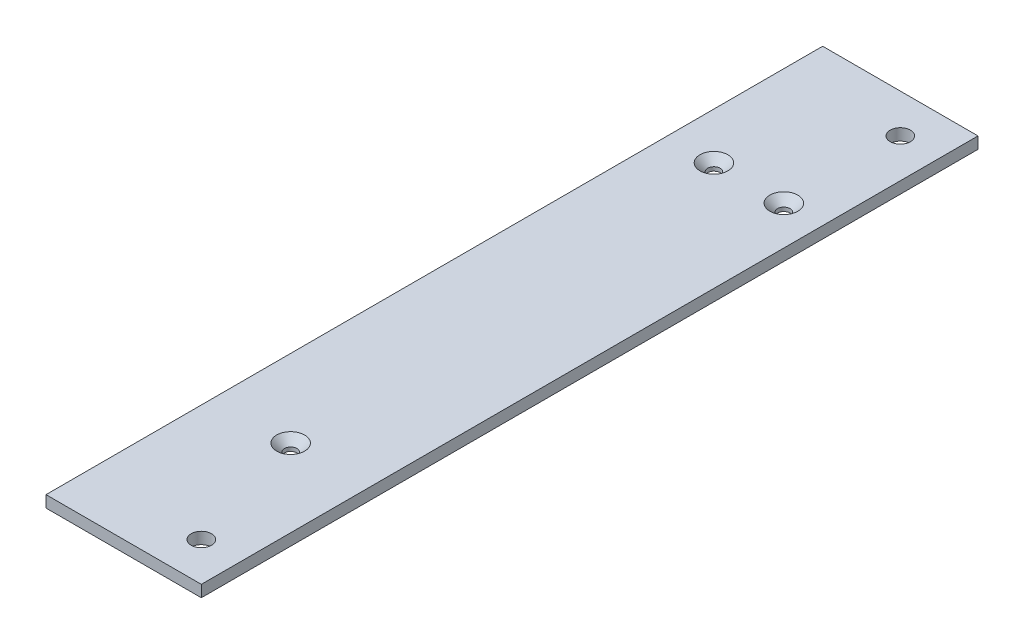
ISO-10303-21;
HEADER;
FILE_DESCRIPTION(('STEP AP214'),'2;1');
FILE_NAME('part.step','',(''),(''),'','','');
FILE_SCHEMA(('AUTOMOTIVE_DESIGN { 1 0 10303 214 1 1 1 1 }'));
ENDSEC;
DATA;
#1=APPLICATION_CONTEXT('core data for automotive mechanical design processes');
#2=APPLICATION_PROTOCOL_DEFINITION('international standard','automotive_design',2000,#1);
#3=PRODUCT_CONTEXT('',#1,'mechanical');
#4=PRODUCT('Part','Part','',(#3));
#5=PRODUCT_RELATED_PRODUCT_CATEGORY('part','',(#4));
#6=PRODUCT_DEFINITION_FORMATION('','',#4);
#7=PRODUCT_DEFINITION_CONTEXT('part definition',#1,'design');
#8=PRODUCT_DEFINITION('design','',#6,#7);
#9=PRODUCT_DEFINITION_SHAPE('','',#8);
#10=(LENGTH_UNIT() NAMED_UNIT(*) SI_UNIT(.MILLI.,.METRE.));
#11=(NAMED_UNIT(*) PLANE_ANGLE_UNIT() SI_UNIT($,.RADIAN.));
#12=(NAMED_UNIT(*) SI_UNIT($,.STERADIAN.) SOLID_ANGLE_UNIT());
#13=UNCERTAINTY_MEASURE_WITH_UNIT(LENGTH_MEASURE(1.E-05),#10,'distance_accuracy_value','');
#14=(GEOMETRIC_REPRESENTATION_CONTEXT(3) GLOBAL_UNCERTAINTY_ASSIGNED_CONTEXT((#13)) GLOBAL_UNIT_ASSIGNED_CONTEXT((#10,
#11,#12)) REPRESENTATION_CONTEXT('',''));
#15=CARTESIAN_POINT('',(0.,0.,0.));
#16=DIRECTION('',(0.,0.,1.));
#17=DIRECTION('',(1.,0.,0.));
#18=AXIS2_PLACEMENT_3D('',#15,#16,#17);
#19=CARTESIAN_POINT('',(0.,3.,0.));
#20=DIRECTION('',(0.,-1.,0.));
#21=DIRECTION('',(0.,0.,-1.));
#22=AXIS2_PLACEMENT_3D('',#19,#20,#21);
#23=PLANE('',#22);
#24=CARTESIAN_POINT('',(0.,3.,57.));
#25=DIRECTION('',(0.,-1.,0.));
#26=DIRECTION('',(0.,0.,-1.));
#27=AXIS2_PLACEMENT_3D('',#24,#25,#26);
#28=CIRCLE('',#27,3.59999999999996);
#29=CARTESIAN_POINT('',(0.,3.,53.4));
#30=VERTEX_POINT('',#29);
#31=EDGE_CURVE('E143',#30,#30,#28,.T.);
#32=ORIENTED_EDGE('',*,*,#31,.T.);
#33=EDGE_LOOP('',(#32));
#34=FACE_BOUND('',#33,.T.);
#35=CARTESIAN_POINT('',(-7.99999999999995,3.,-60.));
#36=DIRECTION('',(0.,-1.,0.));
#37=DIRECTION('',(0.,0.,-1.));
#38=AXIS2_PLACEMENT_3D('',#35,#36,#37);
#39=CIRCLE('',#38,3.59999999999996);
#40=CARTESIAN_POINT('',(-7.99999999999995,3.,-63.6));
#41=VERTEX_POINT('',#40);
#42=EDGE_CURVE('E139',#41,#41,#39,.T.);
#43=ORIENTED_EDGE('',*,*,#42,.T.);
#44=EDGE_LOOP('',(#43));
#45=FACE_BOUND('',#44,.T.);
#46=CARTESIAN_POINT('',(10.,3.,-60.));
#47=DIRECTION('',(0.,-1.,0.));
#48=DIRECTION('',(0.,0.,-1.));
#49=AXIS2_PLACEMENT_3D('',#46,#47,#48);
#50=CIRCLE('',#49,3.59999999999996);
#51=CARTESIAN_POINT('',(10.,3.,-63.6));
#52=VERTEX_POINT('',#51);
#53=EDGE_CURVE('E135',#52,#52,#50,.T.);
#54=ORIENTED_EDGE('',*,*,#53,.T.);
#55=EDGE_LOOP('',(#54));
#56=FACE_BOUND('',#55,.T.);
#57=DIRECTION('',(0.,0.,-1.));
#58=VECTOR('',#57,1.);
#59=CARTESIAN_POINT('',(20.,3.,100.));
#60=LINE('',#59,#58);
#61=CARTESIAN_POINT('',(20.,3.,100.));
#62=VERTEX_POINT('',#61);
#63=CARTESIAN_POINT('',(20.,3.,-100.));
#64=VERTEX_POINT('',#63);
#65=EDGE_CURVE('E95',#62,#64,#60,.T.);
#66=ORIENTED_EDGE('',*,*,#65,.T.);
#67=DIRECTION('',(-1.,0.,0.));
#68=VECTOR('',#67,1.);
#69=CARTESIAN_POINT('',(-20.,3.,-100.));
#70=LINE('',#69,#68);
#71=CARTESIAN_POINT('',(-20.,3.,-100.));
#72=VERTEX_POINT('',#71);
#73=EDGE_CURVE('E90',#64,#72,#70,.T.);
#74=ORIENTED_EDGE('',*,*,#73,.T.);
#75=DIRECTION('',(0.,0.,1.));
#76=VECTOR('',#75,1.);
#77=CARTESIAN_POINT('',(-20.,3.,100.));
#78=LINE('',#77,#76);
#79=CARTESIAN_POINT('',(-20.,3.,100.));
#80=VERTEX_POINT('',#79);
#81=EDGE_CURVE('E93',#72,#80,#78,.T.);
#82=ORIENTED_EDGE('',*,*,#81,.T.);
#83=DIRECTION('',(1.,0.,0.));
#84=VECTOR('',#83,1.);
#85=CARTESIAN_POINT('',(-20.,3.,100.));
#86=LINE('',#85,#84);
#87=EDGE_CURVE('E59',#80,#62,#86,.T.);
#88=ORIENTED_EDGE('',*,*,#87,.T.);
#89=EDGE_LOOP('',(#66,#74,#82,#88));
#90=FACE_BOUND('',#89,.T.);
#91=CARTESIAN_POINT('',(10.0000000000001,3.,90.));
#92=DIRECTION('',(0.,1.,0.));
#93=DIRECTION('',(0.,0.,1.));
#94=AXIS2_PLACEMENT_3D('',#91,#92,#93);
#95=CIRCLE('',#94,2.60000000000001);
#96=CARTESIAN_POINT('',(10.0000000000001,3.,92.6));
#97=VERTEX_POINT('',#96);
#98=EDGE_CURVE('E118',#97,#97,#95,.T.);
#99=ORIENTED_EDGE('',*,*,#98,.F.);
#100=EDGE_LOOP('',(#99));
#101=FACE_BOUND('',#100,.T.);
#102=CARTESIAN_POINT('',(10.,3.,-90.));
#103=DIRECTION('',(0.,1.,0.));
#104=DIRECTION('',(0.,0.,1.));
#105=AXIS2_PLACEMENT_3D('',#102,#103,#104);
#106=CIRCLE('',#105,2.60000000000001);
#107=CARTESIAN_POINT('',(10.,3.,-87.4));
#108=VERTEX_POINT('',#107);
#109=EDGE_CURVE('E225',#108,#108,#106,.T.);
#110=ORIENTED_EDGE('',*,*,#109,.F.);
#111=EDGE_LOOP('',(#110));
#112=FACE_BOUND('',#111,.T.);
#113=ADVANCED_FACE('F40',(#34,#45,#56,#90,#101,#112),#23,.F.);
#114=CARTESIAN_POINT('',(0.,0.,0.));
#115=DIRECTION('',(0.,-1.,0.));
#116=DIRECTION('',(0.,0.,-1.));
#117=AXIS2_PLACEMENT_3D('',#114,#115,#116);
#118=PLANE('',#117);
#119=CARTESIAN_POINT('',(-7.99999999999995,0.,-60.));
#120=DIRECTION('',(0.,1.,0.));
#121=DIRECTION('',(0.,0.,1.));
#122=AXIS2_PLACEMENT_3D('',#119,#120,#121);
#123=CIRCLE('',#122,1.60000000000001);
#124=CARTESIAN_POINT('',(-7.99999999999995,0.,-58.4));
#125=VERTEX_POINT('',#124);
#126=EDGE_CURVE('E216',#125,#125,#123,.T.);
#127=ORIENTED_EDGE('',*,*,#126,.T.);
#128=EDGE_LOOP('',(#127));
#129=FACE_BOUND('',#128,.T.);
#130=CARTESIAN_POINT('',(10.,0.,-90.));
#131=DIRECTION('',(0.,1.,0.));
#132=DIRECTION('',(0.,0.,1.));
#133=AXIS2_PLACEMENT_3D('',#130,#131,#132);
#134=CIRCLE('',#133,2.60000000000001);
#135=CARTESIAN_POINT('',(10.,0.,-87.4));
#136=VERTEX_POINT('',#135);
#137=EDGE_CURVE('E224',#136,#136,#134,.T.);
#138=ORIENTED_EDGE('',*,*,#137,.T.);
#139=EDGE_LOOP('',(#138));
#140=FACE_BOUND('',#139,.T.);
#141=DIRECTION('',(0.,0.,-1.));
#142=VECTOR('',#141,1.);
#143=CARTESIAN_POINT('',(20.,0.,100.));
#144=LINE('',#143,#142);
#145=CARTESIAN_POINT('',(20.,0.,100.));
#146=VERTEX_POINT('',#145);
#147=CARTESIAN_POINT('',(20.,0.,-100.));
#148=VERTEX_POINT('',#147);
#149=EDGE_CURVE('E114',#146,#148,#144,.T.);
#150=ORIENTED_EDGE('',*,*,#149,.F.);
#151=DIRECTION('',(1.,0.,0.));
#152=VECTOR('',#151,1.);
#153=CARTESIAN_POINT('',(-20.,0.,100.));
#154=LINE('',#153,#152);
#155=CARTESIAN_POINT('',(-20.,0.,100.));
#156=VERTEX_POINT('',#155);
#157=EDGE_CURVE('E82',#156,#146,#154,.T.);
#158=ORIENTED_EDGE('',*,*,#157,.F.);
#159=DIRECTION('',(0.,0.,1.));
#160=VECTOR('',#159,1.);
#161=CARTESIAN_POINT('',(-20.,0.,100.));
#162=LINE('',#161,#160);
#163=CARTESIAN_POINT('',(-20.,0.,-100.));
#164=VERTEX_POINT('',#163);
#165=EDGE_CURVE('E76',#164,#156,#162,.T.);
#166=ORIENTED_EDGE('',*,*,#165,.F.);
#167=DIRECTION('',(-1.,0.,0.));
#168=VECTOR('',#167,1.);
#169=CARTESIAN_POINT('',(-20.,0.,-100.));
#170=LINE('',#169,#168);
#171=EDGE_CURVE('E101',#148,#164,#170,.T.);
#172=ORIENTED_EDGE('',*,*,#171,.F.);
#173=EDGE_LOOP('',(#150,#158,#166,#172));
#174=FACE_BOUND('',#173,.T.);
#175=CARTESIAN_POINT('',(10.0000000000001,0.,90.));
#176=DIRECTION('',(0.,1.,0.));
#177=DIRECTION('',(0.,0.,1.));
#178=AXIS2_PLACEMENT_3D('',#175,#176,#177);
#179=CIRCLE('',#178,2.60000000000001);
#180=CARTESIAN_POINT('',(10.0000000000001,0.,92.6));
#181=VERTEX_POINT('',#180);
#182=EDGE_CURVE('E206',#181,#181,#179,.T.);
#183=ORIENTED_EDGE('',*,*,#182,.T.);
#184=EDGE_LOOP('',(#183));
#185=FACE_BOUND('',#184,.T.);
#186=CARTESIAN_POINT('',(10.,0.,-60.));
#187=DIRECTION('',(0.,1.,0.));
#188=DIRECTION('',(0.,0.,1.));
#189=AXIS2_PLACEMENT_3D('',#186,#187,#188);
#190=CIRCLE('',#189,1.6);
#191=CARTESIAN_POINT('',(10.,0.,-58.4));
#192=VERTEX_POINT('',#191);
#193=EDGE_CURVE('E210',#192,#192,#190,.T.);
#194=ORIENTED_EDGE('',*,*,#193,.T.);
#195=EDGE_LOOP('',(#194));
#196=FACE_BOUND('',#195,.T.);
#197=CARTESIAN_POINT('',(0.,0.,57.));
#198=DIRECTION('',(0.,1.,0.));
#199=DIRECTION('',(0.,0.,1.));
#200=AXIS2_PLACEMENT_3D('',#197,#198,#199);
#201=CIRCLE('',#200,1.6);
#202=CARTESIAN_POINT('',(0.,0.,58.6));
#203=VERTEX_POINT('',#202);
#204=EDGE_CURVE('E213',#203,#203,#201,.T.);
#205=ORIENTED_EDGE('',*,*,#204,.T.);
#206=EDGE_LOOP('',(#205));
#207=FACE_BOUND('',#206,.T.);
#208=ADVANCED_FACE('F168',(#129,#140,#174,#185,#196,#207),#118,.T.);
#209=CARTESIAN_POINT('',(20.,3.,100.));
#210=DIRECTION('',(-1.,0.,0.));
#211=DIRECTION('',(0.,0.,1.));
#212=AXIS2_PLACEMENT_3D('',#209,#210,#211);
#213=PLANE('',#212);
#214=ORIENTED_EDGE('',*,*,#149,.T.);
#215=DIRECTION('',(0.,-1.,0.));
#216=VECTOR('',#215,1.);
#217=CARTESIAN_POINT('',(20.,3.,-100.));
#218=LINE('',#217,#216);
#219=EDGE_CURVE('E103',#64,#148,#218,.T.);
#220=ORIENTED_EDGE('',*,*,#219,.F.);
#221=ORIENTED_EDGE('',*,*,#65,.F.);
#222=DIRECTION('',(0.,-1.,0.));
#223=VECTOR('',#222,1.);
#224=CARTESIAN_POINT('',(20.,3.,100.));
#225=LINE('',#224,#223);
#226=EDGE_CURVE('E110',#62,#146,#225,.T.);
#227=ORIENTED_EDGE('',*,*,#226,.T.);
#228=EDGE_LOOP('',(#214,#220,#221,#227));
#229=FACE_BOUND('',#228,.T.);
#230=ADVANCED_FACE('F174',(#229),#213,.F.);
#231=CARTESIAN_POINT('',(-20.,3.,-100.));
#232=DIRECTION('',(0.,0.,1.));
#233=DIRECTION('',(1.,0.,0.));
#234=AXIS2_PLACEMENT_3D('',#231,#232,#233);
#235=PLANE('',#234);
#236=ORIENTED_EDGE('',*,*,#171,.T.);
#237=DIRECTION('',(0.,-1.,0.));
#238=VECTOR('',#237,1.);
#239=CARTESIAN_POINT('',(-20.,3.,-100.));
#240=LINE('',#239,#238);
#241=EDGE_CURVE('E99',#72,#164,#240,.T.);
#242=ORIENTED_EDGE('',*,*,#241,.F.);
#243=ORIENTED_EDGE('',*,*,#73,.F.);
#244=ORIENTED_EDGE('',*,*,#219,.T.);
#245=EDGE_LOOP('',(#236,#242,#243,#244));
#246=FACE_BOUND('',#245,.T.);
#247=ADVANCED_FACE('F100',(#246),#235,.F.);
#248=CARTESIAN_POINT('',(-20.,3.,100.));
#249=DIRECTION('',(1.,0.,0.));
#250=DIRECTION('',(0.,0.,-1.));
#251=AXIS2_PLACEMENT_3D('',#248,#249,#250);
#252=PLANE('',#251);
#253=ORIENTED_EDGE('',*,*,#165,.T.);
#254=DIRECTION('',(0.,-1.,0.));
#255=VECTOR('',#254,1.);
#256=CARTESIAN_POINT('',(-20.,3.,100.));
#257=LINE('',#256,#255);
#258=EDGE_CURVE('E104',#80,#156,#257,.T.);
#259=ORIENTED_EDGE('',*,*,#258,.F.);
#260=ORIENTED_EDGE('',*,*,#81,.F.);
#261=ORIENTED_EDGE('',*,*,#241,.T.);
#262=EDGE_LOOP('',(#253,#259,#260,#261));
#263=FACE_BOUND('',#262,.T.);
#264=ADVANCED_FACE('F106',(#263),#252,.F.);
#265=CARTESIAN_POINT('',(-20.,3.,100.));
#266=DIRECTION('',(0.,0.,-1.));
#267=DIRECTION('',(-1.,0.,0.));
#268=AXIS2_PLACEMENT_3D('',#265,#266,#267);
#269=PLANE('',#268);
#270=ORIENTED_EDGE('',*,*,#157,.T.);
#271=ORIENTED_EDGE('',*,*,#226,.F.);
#272=ORIENTED_EDGE('',*,*,#87,.F.);
#273=ORIENTED_EDGE('',*,*,#258,.T.);
#274=EDGE_LOOP('',(#270,#271,#272,#273));
#275=FACE_BOUND('',#274,.T.);
#276=ADVANCED_FACE('F182',(#275),#269,.F.);
#277=CARTESIAN_POINT('',(10.0000000000001,3.,90.));
#278=DIRECTION('',(0.,-1.,0.));
#279=DIRECTION('',(0.,0.,-1.));
#280=AXIS2_PLACEMENT_3D('',#277,#278,#279);
#281=CYLINDRICAL_SURFACE('',#280,2.60000000000001);
#282=ORIENTED_EDGE('',*,*,#98,.T.);
#283=EDGE_LOOP('',(#282));
#284=FACE_BOUND('',#283,.T.);
#285=ORIENTED_EDGE('',*,*,#182,.F.);
#286=EDGE_LOOP('',(#285));
#287=FACE_BOUND('',#286,.T.);
#288=ADVANCED_FACE('F179',(#284,#287),#281,.F.);
#289=CARTESIAN_POINT('',(10.,3.,-90.));
#290=DIRECTION('',(0.,-1.,0.));
#291=DIRECTION('',(0.,0.,-1.));
#292=AXIS2_PLACEMENT_3D('',#289,#290,#291);
#293=CYLINDRICAL_SURFACE('',#292,2.60000000000001);
#294=ORIENTED_EDGE('',*,*,#109,.T.);
#295=EDGE_LOOP('',(#294));
#296=FACE_BOUND('',#295,.T.);
#297=ORIENTED_EDGE('',*,*,#137,.F.);
#298=EDGE_LOOP('',(#297));
#299=FACE_BOUND('',#298,.T.);
#300=ADVANCED_FACE('F243',(#296,#299),#293,.F.);
#301=CARTESIAN_POINT('',(10.,3.,-60.));
#302=DIRECTION('',(0.,-1.,0.));
#303=DIRECTION('',(0.,0.,-1.));
#304=AXIS2_PLACEMENT_3D('',#301,#302,#303);
#305=CYLINDRICAL_SURFACE('',#304,1.6);
#306=CARTESIAN_POINT('',(10.,1.00000000000003,-60.));
#307=DIRECTION('',(0.,-1.,0.));
#308=DIRECTION('',(0.,0.,-1.));
#309=AXIS2_PLACEMENT_3D('',#306,#307,#308);
#310=CIRCLE('',#309,1.6);
#311=CARTESIAN_POINT('',(10.,1.00000000000003,-61.6));
#312=VERTEX_POINT('',#311);
#313=EDGE_CURVE('E11',#312,#312,#310,.F.);
#314=ORIENTED_EDGE('',*,*,#313,.T.);
#315=EDGE_LOOP('',(#314));
#316=FACE_BOUND('',#315,.T.);
#317=ORIENTED_EDGE('',*,*,#193,.F.);
#318=EDGE_LOOP('',(#317));
#319=FACE_BOUND('',#318,.T.);
#320=ADVANCED_FACE('F246',(#316,#319),#305,.F.);
#321=CARTESIAN_POINT('',(-7.99999999999995,3.,-60.));
#322=DIRECTION('',(0.,-1.,0.));
#323=DIRECTION('',(0.,0.,-1.));
#324=AXIS2_PLACEMENT_3D('',#321,#322,#323);
#325=CYLINDRICAL_SURFACE('',#324,1.60000000000001);
#326=CARTESIAN_POINT('',(-7.99999999999995,1.00000000000004,-60.));
#327=DIRECTION('',(0.,-1.,0.));
#328=DIRECTION('',(0.,0.,-1.));
#329=AXIS2_PLACEMENT_3D('',#326,#327,#328);
#330=CIRCLE('',#329,1.60000000000001);
#331=CARTESIAN_POINT('',(-7.99999999999995,1.00000000000004,-61.6));
#332=VERTEX_POINT('',#331);
#333=EDGE_CURVE('E51',#332,#332,#330,.F.);
#334=ORIENTED_EDGE('',*,*,#333,.T.);
#335=EDGE_LOOP('',(#334));
#336=FACE_BOUND('',#335,.T.);
#337=ORIENTED_EDGE('',*,*,#126,.F.);
#338=EDGE_LOOP('',(#337));
#339=FACE_BOUND('',#338,.T.);
#340=ADVANCED_FACE('F150',(#336,#339),#325,.F.);
#341=CARTESIAN_POINT('',(0.,3.,57.));
#342=DIRECTION('',(0.,-1.,0.));
#343=DIRECTION('',(0.,0.,-1.));
#344=AXIS2_PLACEMENT_3D('',#341,#342,#343);
#345=CYLINDRICAL_SURFACE('',#344,1.6);
#346=CARTESIAN_POINT('',(0.,1.00000000000003,57.));
#347=DIRECTION('',(0.,-1.,0.));
#348=DIRECTION('',(0.,0.,-1.));
#349=AXIS2_PLACEMENT_3D('',#346,#347,#348);
#350=CIRCLE('',#349,1.6);
#351=CARTESIAN_POINT('',(0.,1.00000000000003,55.4));
#352=VERTEX_POINT('',#351);
#353=EDGE_CURVE('E131',#352,#352,#350,.F.);
#354=ORIENTED_EDGE('',*,*,#353,.T.);
#355=EDGE_LOOP('',(#354));
#356=FACE_BOUND('',#355,.T.);
#357=ORIENTED_EDGE('',*,*,#204,.F.);
#358=EDGE_LOOP('',(#357));
#359=FACE_BOUND('',#358,.T.);
#360=ADVANCED_FACE('F162',(#356,#359),#345,.F.);
#361=CARTESIAN_POINT('',(0.,1.00000000000003,57.));
#362=DIRECTION('',(0.,1.,0.));
#363=DIRECTION('',(0.,0.,1.));
#364=AXIS2_PLACEMENT_3D('',#361,#362,#363);
#365=CONICAL_SURFACE('',#364,1.6,0.785398163397447);
#366=ORIENTED_EDGE('',*,*,#31,.F.);
#367=EDGE_LOOP('',(#366));
#368=FACE_BOUND('',#367,.T.);
#369=ORIENTED_EDGE('',*,*,#353,.F.);
#370=EDGE_LOOP('',(#369));
#371=FACE_BOUND('',#370,.T.);
#372=ADVANCED_FACE('F155',(#368,#371),#365,.F.);
#373=CARTESIAN_POINT('',(-7.99999999999995,1.00000000000004,-60.));
#374=DIRECTION('',(0.,1.,0.));
#375=DIRECTION('',(0.,0.,1.));
#376=AXIS2_PLACEMENT_3D('',#373,#374,#375);
#377=CONICAL_SURFACE('',#376,1.60000000000001,0.785398163397447);
#378=ORIENTED_EDGE('',*,*,#42,.F.);
#379=EDGE_LOOP('',(#378));
#380=FACE_BOUND('',#379,.T.);
#381=ORIENTED_EDGE('',*,*,#333,.F.);
#382=EDGE_LOOP('',(#381));
#383=FACE_BOUND('',#382,.T.);
#384=ADVANCED_FACE('F153',(#380,#383),#377,.F.);
#385=CARTESIAN_POINT('',(10.,1.00000000000003,-60.));
#386=DIRECTION('',(0.,1.,0.));
#387=DIRECTION('',(0.,0.,1.));
#388=AXIS2_PLACEMENT_3D('',#385,#386,#387);
#389=CONICAL_SURFACE('',#388,1.6,0.785398163397447);
#390=ORIENTED_EDGE('',*,*,#53,.F.);
#391=EDGE_LOOP('',(#390));
#392=FACE_BOUND('',#391,.T.);
#393=ORIENTED_EDGE('',*,*,#313,.F.);
#394=EDGE_LOOP('',(#393));
#395=FACE_BOUND('',#394,.T.);
#396=ADVANCED_FACE('F43',(#392,#395),#389,.F.);
#397=CLOSED_SHELL('',(#113,#208,#230,#247,#264,#276,#288,#300,#320,#340,#360,#372,#384,#396));
#398=MANIFOLD_SOLID_BREP('B2',#397);
#399=ADVANCED_BREP_SHAPE_REPRESENTATION('',(#18,#398),#14);
#400=SHAPE_DEFINITION_REPRESENTATION(#9,#399);
ENDSEC;
END-ISO-10303-21;
